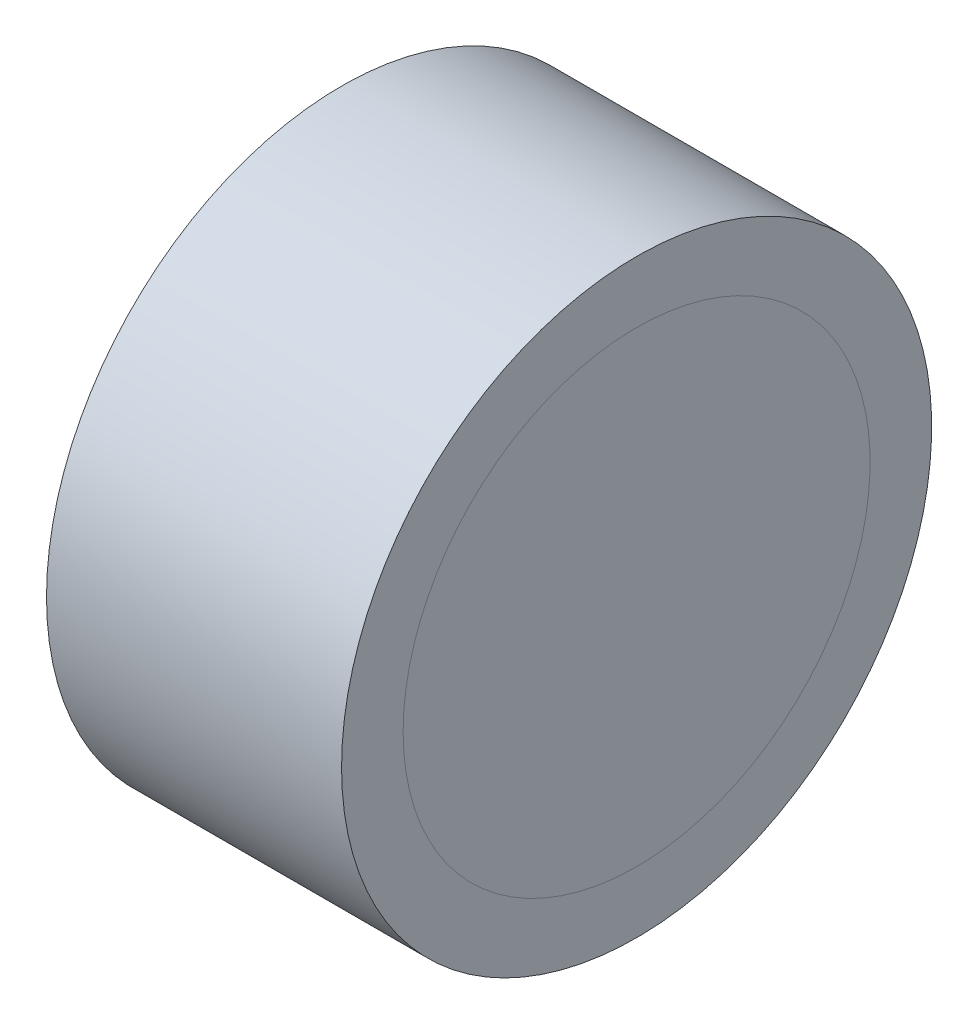
ISO-10303-21;
HEADER;
FILE_DESCRIPTION(('STEP AP214'),'2;1');
FILE_NAME('part.step','',(''),(''),'','','');
FILE_SCHEMA(('AUTOMOTIVE_DESIGN { 1 0 10303 214 1 1 1 1 }'));
ENDSEC;
DATA;
#1=APPLICATION_CONTEXT('core data for automotive mechanical design processes');
#2=APPLICATION_PROTOCOL_DEFINITION('international standard','automotive_design',2000,#1);
#3=PRODUCT_CONTEXT('',#1,'mechanical');
#4=PRODUCT('Part','Part','',(#3));
#5=PRODUCT_RELATED_PRODUCT_CATEGORY('part','',(#4));
#6=PRODUCT_DEFINITION_FORMATION('','',#4);
#7=PRODUCT_DEFINITION_CONTEXT('part definition',#1,'design');
#8=PRODUCT_DEFINITION('design','',#6,#7);
#9=PRODUCT_DEFINITION_SHAPE('','',#8);
#10=(LENGTH_UNIT() NAMED_UNIT(*) SI_UNIT(.MILLI.,.METRE.));
#11=(NAMED_UNIT(*) PLANE_ANGLE_UNIT() SI_UNIT($,.RADIAN.));
#12=(NAMED_UNIT(*) SI_UNIT($,.STERADIAN.) SOLID_ANGLE_UNIT());
#13=UNCERTAINTY_MEASURE_WITH_UNIT(LENGTH_MEASURE(1.E-05),#10,'distance_accuracy_value','');
#14=(GEOMETRIC_REPRESENTATION_CONTEXT(3) GLOBAL_UNCERTAINTY_ASSIGNED_CONTEXT((#13)) GLOBAL_UNIT_ASSIGNED_CONTEXT((#10,
#11,#12)) REPRESENTATION_CONTEXT('',''));
#15=CARTESIAN_POINT('',(0.,0.,0.));
#16=DIRECTION('',(0.,0.,1.));
#17=DIRECTION('',(1.,0.,0.));
#18=AXIS2_PLACEMENT_3D('',#15,#16,#17);
#19=CARTESIAN_POINT('',(233.114519084922,0.,0.));
#20=DIRECTION('',(1.,0.,0.));
#21=DIRECTION('',(0.,0.,-1.));
#22=AXIS2_PLACEMENT_3D('',#19,#20,#21);
#23=PLANE('',#22);
#24=CARTESIAN_POINT('',(233.114519084922,108.225695895238,0.));
#25=DIRECTION('',(-1.,0.,0.));
#26=DIRECTION('',(0.,0.,1.));
#27=AXIS2_PLACEMENT_3D('',#24,#25,#26);
#28=CIRCLE('',#27,5.02500000000003);
#29=CARTESIAN_POINT('',(233.114519084922,108.225695895238,5.02500000000003));
#30=VERTEX_POINT('',#29);
#31=EDGE_CURVE('E48',#30,#30,#28,.T.);
#32=ORIENTED_EDGE('',*,*,#31,.T.);
#33=EDGE_LOOP('',(#32));
#34=FACE_BOUND('',#33,.T.);
#35=ADVANCED_FACE('F42',(#34),#23,.F.);
#36=CARTESIAN_POINT('',(234.114519084922,0.,0.));
#37=DIRECTION('',(1.,0.,0.));
#38=DIRECTION('',(0.,0.,-1.));
#39=AXIS2_PLACEMENT_3D('',#36,#37,#38);
#40=PLANE('',#39);
#41=CARTESIAN_POINT('',(234.114519084922,108.225695895238,0.));
#42=DIRECTION('',(-1.,0.,0.));
#43=DIRECTION('',(0.,0.,1.));
#44=AXIS2_PLACEMENT_3D('',#41,#42,#43);
#45=CIRCLE('',#44,5.02500000000002);
#46=CARTESIAN_POINT('',(234.114519084922,108.225695895238,5.02500000000002));
#47=VERTEX_POINT('',#46);
#48=EDGE_CURVE('E11',#47,#47,#45,.T.);
#49=ORIENTED_EDGE('',*,*,#48,.F.);
#50=EDGE_LOOP('',(#49));
#51=FACE_BOUND('',#50,.T.);
#52=ADVANCED_FACE('F57',(#51),#40,.T.);
#53=CARTESIAN_POINT('',(219.902332255985,108.225695895238,0.));
#54=DIRECTION('',(-1.,0.,0.));
#55=DIRECTION('',(0.,0.,1.));
#56=AXIS2_PLACEMENT_3D('',#53,#54,#55);
#57=CYLINDRICAL_SURFACE('',#56,5.02500000000002);
#58=ORIENTED_EDGE('',*,*,#48,.T.);
#59=EDGE_LOOP('',(#58));
#60=FACE_BOUND('',#59,.T.);
#61=ORIENTED_EDGE('',*,*,#31,.F.);
#62=EDGE_LOOP('',(#61));
#63=FACE_BOUND('',#62,.T.);
#64=ADVANCED_FACE('F55',(#60,#63),#57,.T.);
#65=CLOSED_SHELL('',(#35,#52,#64));
#66=MANIFOLD_SOLID_BREP('B2',#65);
#67=CARTESIAN_POINT('',(227.764519084922,0.,0.));
#68=DIRECTION('',(1.,0.,0.));
#69=DIRECTION('',(0.,0.,-1.));
#70=AXIS2_PLACEMENT_3D('',#67,#68,#69);
#71=PLANE('',#70);
#72=CARTESIAN_POINT('',(227.764519084922,108.225695895238,0.));
#73=DIRECTION('',(-1.,0.,0.));
#74=DIRECTION('',(0.,0.,1.));
#75=AXIS2_PLACEMENT_3D('',#72,#73,#74);
#76=CIRCLE('',#75,5.025);
#77=CARTESIAN_POINT('',(227.764519084922,108.225695895238,5.025));
#78=VERTEX_POINT('',#77);
#79=EDGE_CURVE('E96',#78,#78,#76,.T.);
#80=ORIENTED_EDGE('',*,*,#79,.T.);
#81=EDGE_LOOP('',(#80));
#82=FACE_BOUND('',#81,.T.);
#83=ADVANCED_FACE('F90',(#82),#71,.F.);
#84=CARTESIAN_POINT('',(228.764519084922,2.52716056025256E-12,0.));
#85=DIRECTION('',(1.,0.,0.));
#86=DIRECTION('',(0.,0.,-1.));
#87=AXIS2_PLACEMENT_3D('',#84,#85,#86);
#88=PLANE('',#87);
#89=CARTESIAN_POINT('',(228.764519084922,108.225695895238,0.));
#90=DIRECTION('',(-1.,0.,0.));
#91=DIRECTION('',(0.,0.,1.));
#92=AXIS2_PLACEMENT_3D('',#89,#90,#91);
#93=CIRCLE('',#92,5.025);
#94=CARTESIAN_POINT('',(228.764519084922,108.225695895238,5.025));
#95=VERTEX_POINT('',#94);
#96=EDGE_CURVE('E41',#95,#95,#93,.T.);
#97=ORIENTED_EDGE('',*,*,#96,.F.);
#98=EDGE_LOOP('',(#97));
#99=FACE_BOUND('',#98,.T.);
#100=ADVANCED_FACE('F105',(#99),#88,.T.);
#101=CARTESIAN_POINT('',(219.902332255985,108.225695895238,0.));
#102=DIRECTION('',(-1.,0.,0.));
#103=DIRECTION('',(0.,0.,1.));
#104=AXIS2_PLACEMENT_3D('',#101,#102,#103);
#105=CYLINDRICAL_SURFACE('',#104,5.025);
#106=ORIENTED_EDGE('',*,*,#96,.T.);
#107=EDGE_LOOP('',(#106));
#108=FACE_BOUND('',#107,.T.);
#109=ORIENTED_EDGE('',*,*,#79,.F.);
#110=EDGE_LOOP('',(#109));
#111=FACE_BOUND('',#110,.T.);
#112=ADVANCED_FACE('F103',(#108,#111),#105,.T.);
#113=CLOSED_SHELL('',(#83,#100,#112));
#114=MANIFOLD_SOLID_BREP('B6',#113);
#115=CARTESIAN_POINT('',(228.764519084922,2.52716056025256E-12,0.));
#116=DIRECTION('',(1.,0.,0.));
#117=DIRECTION('',(0.,0.,-1.));
#118=AXIS2_PLACEMENT_3D('',#115,#116,#117);
#119=PLANE('',#118);
#120=CARTESIAN_POINT('',(228.764519084922,108.225695895238,0.));
#121=DIRECTION('',(-1.,0.,0.));
#122=DIRECTION('',(0.,0.,1.));
#123=AXIS2_PLACEMENT_3D('',#120,#121,#122);
#124=CIRCLE('',#123,4.05);
#125=CARTESIAN_POINT('',(228.764519084922,108.225695895238,4.05));
#126=VERTEX_POINT('',#125);
#127=EDGE_CURVE('E89',#126,#126,#124,.T.);
#128=ORIENTED_EDGE('',*,*,#127,.F.);
#129=EDGE_LOOP('',(#128));
#130=FACE_BOUND('',#129,.T.);
#131=CARTESIAN_POINT('',(228.764519084922,108.225695895238,0.));
#132=DIRECTION('',(-1.,0.,0.));
#133=DIRECTION('',(0.,0.,1.));
#134=AXIS2_PLACEMENT_3D('',#131,#132,#133);
#135=CIRCLE('',#134,5.025);
#136=CARTESIAN_POINT('',(228.764519084922,108.225695895238,5.025));
#137=VERTEX_POINT('',#136);
#138=EDGE_CURVE('E159',#137,#137,#135,.T.);
#139=ORIENTED_EDGE('',*,*,#138,.T.);
#140=EDGE_LOOP('',(#139));
#141=FACE_BOUND('',#140,.T.);
#142=ADVANCED_FACE('F131',(#130,#141),#119,.F.);
#143=CARTESIAN_POINT('',(219.902332255985,108.225695895238,0.));
#144=DIRECTION('',(-1.,0.,0.));
#145=DIRECTION('',(0.,0.,1.));
#146=AXIS2_PLACEMENT_3D('',#143,#144,#145);
#147=CYLINDRICAL_SURFACE('',#146,4.05);
#148=CARTESIAN_POINT('',(233.114519084922,108.225695895238,0.));
#149=DIRECTION('',(-1.,0.,0.));
#150=DIRECTION('',(0.,0.,1.));
#151=AXIS2_PLACEMENT_3D('',#148,#149,#150);
#152=CIRCLE('',#151,4.05);
#153=CARTESIAN_POINT('',(233.114519084922,108.225695895238,4.05));
#154=VERTEX_POINT('',#153);
#155=EDGE_CURVE('E137',#154,#154,#152,.T.);
#156=ORIENTED_EDGE('',*,*,#155,.F.);
#157=EDGE_LOOP('',(#156));
#158=FACE_BOUND('',#157,.T.);
#159=ORIENTED_EDGE('',*,*,#127,.T.);
#160=EDGE_LOOP('',(#159));
#161=FACE_BOUND('',#160,.T.);
#162=ADVANCED_FACE('F188',(#158,#161),#147,.F.);
#163=CARTESIAN_POINT('',(233.114519084922,0.,0.));
#164=DIRECTION('',(1.,0.,0.));
#165=DIRECTION('',(0.,0.,-1.));
#166=AXIS2_PLACEMENT_3D('',#163,#164,#165);
#167=PLANE('',#166);
#168=ORIENTED_EDGE('',*,*,#155,.T.);
#169=EDGE_LOOP('',(#168));
#170=FACE_BOUND('',#169,.T.);
#171=CARTESIAN_POINT('',(233.114519084922,108.225695895238,0.));
#172=DIRECTION('',(-1.,0.,0.));
#173=DIRECTION('',(0.,0.,1.));
#174=AXIS2_PLACEMENT_3D('',#171,#172,#173);
#175=CIRCLE('',#174,5.02500000000003);
#176=CARTESIAN_POINT('',(233.114519084922,108.225695895238,5.02500000000003));
#177=VERTEX_POINT('',#176);
#178=EDGE_CURVE('E141',#177,#177,#175,.T.);
#179=ORIENTED_EDGE('',*,*,#178,.F.);
#180=EDGE_LOOP('',(#179));
#181=FACE_BOUND('',#180,.T.);
#182=ADVANCED_FACE('F193',(#170,#181),#167,.T.);
#183=CARTESIAN_POINT('',(219.902332255985,108.225695895238,0.));
#184=DIRECTION('',(-1.,0.,0.));
#185=DIRECTION('',(0.,0.,1.));
#186=AXIS2_PLACEMENT_3D('',#183,#184,#185);
#187=CYLINDRICAL_SURFACE('',#186,5.02500000000002);
#188=CARTESIAN_POINT('',(234.114519084922,108.225695895238,0.));
#189=DIRECTION('',(-1.,0.,0.));
#190=DIRECTION('',(0.,0.,1.));
#191=AXIS2_PLACEMENT_3D('',#188,#189,#190);
#192=CIRCLE('',#191,5.02500000000002);
#193=CARTESIAN_POINT('',(234.114519084922,108.225695895238,5.02500000000002));
#194=VERTEX_POINT('',#193);
#195=EDGE_CURVE('E145',#194,#194,#192,.T.);
#196=ORIENTED_EDGE('',*,*,#195,.F.);
#197=EDGE_LOOP('',(#196));
#198=FACE_BOUND('',#197,.T.);
#199=ORIENTED_EDGE('',*,*,#178,.T.);
#200=EDGE_LOOP('',(#199));
#201=FACE_BOUND('',#200,.T.);
#202=ADVANCED_FACE('F184',(#198,#201),#187,.F.);
#203=CARTESIAN_POINT('',(234.114519084922,0.,0.));
#204=DIRECTION('',(1.,0.,0.));
#205=DIRECTION('',(0.,0.,-1.));
#206=AXIS2_PLACEMENT_3D('',#203,#204,#205);
#207=PLANE('',#206);
#208=ORIENTED_EDGE('',*,*,#195,.T.);
#209=EDGE_LOOP('',(#208));
#210=FACE_BOUND('',#209,.T.);
#211=CARTESIAN_POINT('',(234.114519084922,108.225695895238,0.));
#212=DIRECTION('',(-1.,0.,0.));
#213=DIRECTION('',(0.,0.,1.));
#214=AXIS2_PLACEMENT_3D('',#211,#212,#213);
#215=CIRCLE('',#214,6.35000000000001);
#216=CARTESIAN_POINT('',(234.114519084922,108.225695895238,6.35000000000001));
#217=VERTEX_POINT('',#216);
#218=EDGE_CURVE('E150',#217,#217,#215,.T.);
#219=ORIENTED_EDGE('',*,*,#218,.F.);
#220=EDGE_LOOP('',(#219));
#221=FACE_BOUND('',#220,.T.);
#222=ADVANCED_FACE('F178',(#210,#221),#207,.T.);
#223=CARTESIAN_POINT('',(219.902332255985,108.225695895238,0.));
#224=DIRECTION('',(-1.,0.,0.));
#225=DIRECTION('',(0.,0.,1.));
#226=AXIS2_PLACEMENT_3D('',#223,#224,#225);
#227=CYLINDRICAL_SURFACE('',#226,6.35000000000001);
#228=ORIENTED_EDGE('',*,*,#218,.T.);
#229=EDGE_LOOP('',(#228));
#230=FACE_BOUND('',#229,.T.);
#231=CARTESIAN_POINT('',(227.764519084922,108.225695895238,0.));
#232=DIRECTION('',(-1.,0.,0.));
#233=DIRECTION('',(0.,0.,1.));
#234=AXIS2_PLACEMENT_3D('',#231,#232,#233);
#235=CIRCLE('',#234,6.35000000000001);
#236=CARTESIAN_POINT('',(227.764519084922,108.225695895238,6.35000000000001));
#237=VERTEX_POINT('',#236);
#238=EDGE_CURVE('E153',#237,#237,#235,.T.);
#239=ORIENTED_EDGE('',*,*,#238,.F.);
#240=EDGE_LOOP('',(#239));
#241=FACE_BOUND('',#240,.T.);
#242=ADVANCED_FACE('F173',(#230,#241),#227,.T.);
#243=CARTESIAN_POINT('',(227.764519084922,0.,0.));
#244=DIRECTION('',(1.,0.,0.));
#245=DIRECTION('',(0.,0.,-1.));
#246=AXIS2_PLACEMENT_3D('',#243,#244,#245);
#247=PLANE('',#246);
#248=CARTESIAN_POINT('',(227.764519084922,108.225695895238,0.));
#249=DIRECTION('',(-1.,0.,0.));
#250=DIRECTION('',(0.,0.,1.));
#251=AXIS2_PLACEMENT_3D('',#248,#249,#250);
#252=CIRCLE('',#251,5.025);
#253=CARTESIAN_POINT('',(227.764519084922,108.225695895238,5.025));
#254=VERTEX_POINT('',#253);
#255=EDGE_CURVE('E156',#254,#254,#252,.T.);
#256=ORIENTED_EDGE('',*,*,#255,.F.);
#257=EDGE_LOOP('',(#256));
#258=FACE_BOUND('',#257,.T.);
#259=ORIENTED_EDGE('',*,*,#238,.T.);
#260=EDGE_LOOP('',(#259));
#261=FACE_BOUND('',#260,.T.);
#262=ADVANCED_FACE('F167',(#258,#261),#247,.F.);
#263=CARTESIAN_POINT('',(219.902332255985,108.225695895238,0.));
#264=DIRECTION('',(-1.,0.,0.));
#265=DIRECTION('',(0.,0.,1.));
#266=AXIS2_PLACEMENT_3D('',#263,#264,#265);
#267=CYLINDRICAL_SURFACE('',#266,5.025);
#268=ORIENTED_EDGE('',*,*,#138,.F.);
#269=EDGE_LOOP('',(#268));
#270=FACE_BOUND('',#269,.T.);
#271=ORIENTED_EDGE('',*,*,#255,.T.);
#272=EDGE_LOOP('',(#271));
#273=FACE_BOUND('',#272,.T.);
#274=ADVANCED_FACE('F164',(#270,#273),#267,.F.);
#275=CLOSED_SHELL('',(#142,#162,#182,#202,#222,#242,#262,#274));
#276=MANIFOLD_SOLID_BREP('B36',#275);
#277=ADVANCED_BREP_SHAPE_REPRESENTATION('',(#18,#66,#114,#276),#14);
#278=SHAPE_DEFINITION_REPRESENTATION(#9,#277);
ENDSEC;
END-ISO-10303-21;
